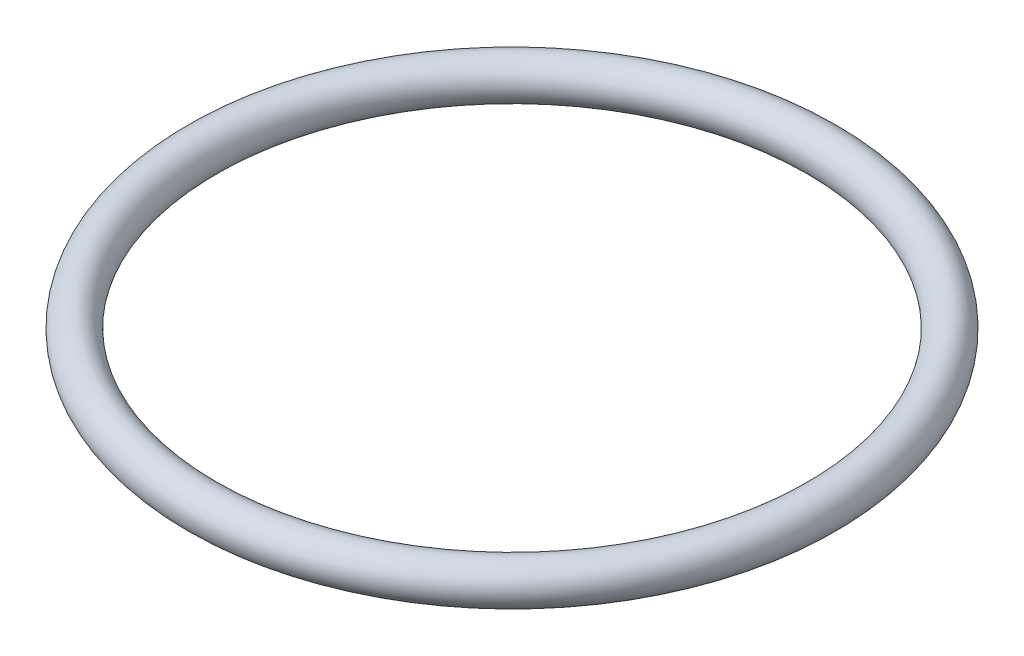
ISO-10303-21;
HEADER;
FILE_DESCRIPTION(('STEP AP214'),'2;1');
FILE_NAME('part.step','',(''),(''),'','','');
FILE_SCHEMA(('AUTOMOTIVE_DESIGN { 1 0 10303 214 1 1 1 1 }'));
ENDSEC;
DATA;
#1=APPLICATION_CONTEXT('core data for automotive mechanical design processes');
#2=APPLICATION_PROTOCOL_DEFINITION('international standard','automotive_design',2000,#1);
#3=PRODUCT_CONTEXT('',#1,'mechanical');
#4=PRODUCT('Part','Part','',(#3));
#5=PRODUCT_RELATED_PRODUCT_CATEGORY('part','',(#4));
#6=PRODUCT_DEFINITION_FORMATION('','',#4);
#7=PRODUCT_DEFINITION_CONTEXT('part definition',#1,'design');
#8=PRODUCT_DEFINITION('design','',#6,#7);
#9=PRODUCT_DEFINITION_SHAPE('','',#8);
#10=(LENGTH_UNIT() NAMED_UNIT(*) SI_UNIT(.MILLI.,.METRE.));
#11=(NAMED_UNIT(*) PLANE_ANGLE_UNIT() SI_UNIT($,.RADIAN.));
#12=(NAMED_UNIT(*) SI_UNIT($,.STERADIAN.) SOLID_ANGLE_UNIT());
#13=UNCERTAINTY_MEASURE_WITH_UNIT(LENGTH_MEASURE(1.E-05),#10,'distance_accuracy_value','');
#14=(GEOMETRIC_REPRESENTATION_CONTEXT(3) GLOBAL_UNCERTAINTY_ASSIGNED_CONTEXT((#13)) GLOBAL_UNIT_ASSIGNED_CONTEXT((#10,
#11,#12)) REPRESENTATION_CONTEXT('',''));
#15=CARTESIAN_POINT('',(0.,0.,0.));
#16=DIRECTION('',(0.,0.,1.));
#17=DIRECTION('',(1.,0.,0.));
#18=AXIS2_PLACEMENT_3D('',#15,#16,#17);
#19=CARTESIAN_POINT('',(0.,0.,0.));
#20=DIRECTION('',(0.,-1.,0.));
#21=DIRECTION('',(0.,0.,-1.));
#22=AXIS2_PLACEMENT_3D('',#19,#20,#21);
#23=TOROIDAL_SURFACE('',#22,108.,7.);
#24=CARTESIAN_POINT('',(0.,0.,-115.));
#25=VERTEX_POINT('',#24);
#26=VERTEX_LOOP('',#25);
#27=FACE_BOUND('',#26,.T.);
#28=ADVANCED_FACE('F31',(#27),#23,.T.);
#29=CLOSED_SHELL('',(#28));
#30=MANIFOLD_SOLID_BREP('B2',#29);
#31=ADVANCED_BREP_SHAPE_REPRESENTATION('',(#18,#30),#14);
#32=SHAPE_DEFINITION_REPRESENTATION(#9,#31);
ENDSEC;
END-ISO-10303-21;
